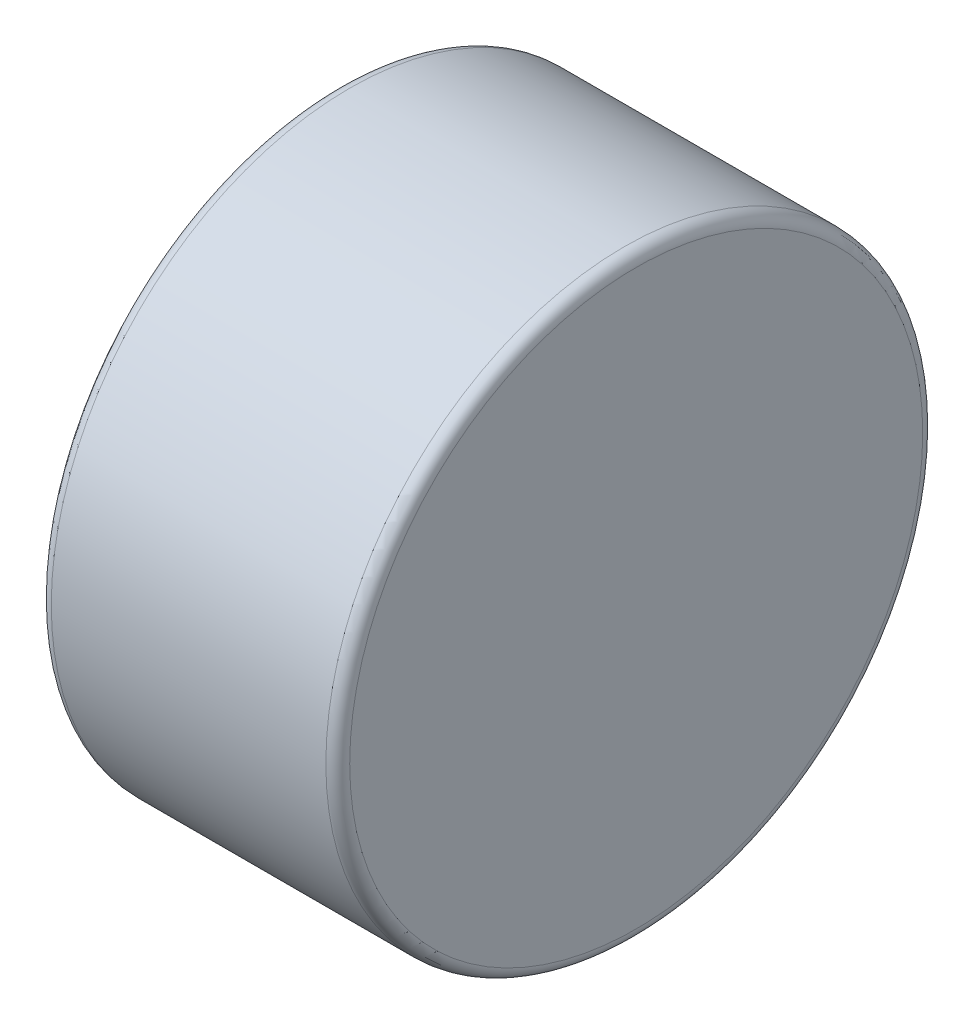
ISO-10303-21;
HEADER;
FILE_DESCRIPTION(('STEP AP214'),'2;1');
FILE_NAME('part.step','',(''),(''),'','','');
FILE_SCHEMA(('AUTOMOTIVE_DESIGN { 1 0 10303 214 1 1 1 1 }'));
ENDSEC;
DATA;
#1=APPLICATION_CONTEXT('core data for automotive mechanical design processes');
#2=APPLICATION_PROTOCOL_DEFINITION('international standard','automotive_design',2000,#1);
#3=PRODUCT_CONTEXT('',#1,'mechanical');
#4=PRODUCT('Part','Part','',(#3));
#5=PRODUCT_RELATED_PRODUCT_CATEGORY('part','',(#4));
#6=PRODUCT_DEFINITION_FORMATION('','',#4);
#7=PRODUCT_DEFINITION_CONTEXT('part definition',#1,'design');
#8=PRODUCT_DEFINITION('design','',#6,#7);
#9=PRODUCT_DEFINITION_SHAPE('','',#8);
#10=(LENGTH_UNIT() NAMED_UNIT(*) SI_UNIT(.MILLI.,.METRE.));
#11=(NAMED_UNIT(*) PLANE_ANGLE_UNIT() SI_UNIT($,.RADIAN.));
#12=(NAMED_UNIT(*) SI_UNIT($,.STERADIAN.) SOLID_ANGLE_UNIT());
#13=UNCERTAINTY_MEASURE_WITH_UNIT(LENGTH_MEASURE(1.E-05),#10,'distance_accuracy_value','');
#14=(GEOMETRIC_REPRESENTATION_CONTEXT(3) GLOBAL_UNCERTAINTY_ASSIGNED_CONTEXT((#13)) GLOBAL_UNIT_ASSIGNED_CONTEXT((#10,
#11,#12)) REPRESENTATION_CONTEXT('',''));
#15=CARTESIAN_POINT('',(0.,0.,0.));
#16=DIRECTION('',(0.,0.,1.));
#17=DIRECTION('',(1.,0.,0.));
#18=AXIS2_PLACEMENT_3D('',#15,#16,#17);
#19=CARTESIAN_POINT('',(2.5,0.,0.));
#20=DIRECTION('',(-1.,0.,0.));
#21=DIRECTION('',(0.,0.,1.));
#22=AXIS2_PLACEMENT_3D('',#19,#20,#21);
#23=CYLINDRICAL_SURFACE('',#22,5.);
#24=CARTESIAN_POINT('',(2.3,0.,0.));
#25=DIRECTION('',(1.,0.,0.));
#26=DIRECTION('',(0.,0.,-1.));
#27=AXIS2_PLACEMENT_3D('',#24,#25,#26);
#28=CIRCLE('',#27,5.);
#29=CARTESIAN_POINT('',(2.3,0.,-5.));
#30=VERTEX_POINT('',#29);
#31=EDGE_CURVE('E46',#30,#30,#28,.F.);
#32=ORIENTED_EDGE('',*,*,#31,.T.);
#33=EDGE_LOOP('',(#32));
#34=FACE_BOUND('',#33,.T.);
#35=CARTESIAN_POINT('',(-2.3,0.,0.));
#36=DIRECTION('',(1.,0.,0.));
#37=DIRECTION('',(0.,0.,-1.));
#38=AXIS2_PLACEMENT_3D('',#35,#36,#37);
#39=CIRCLE('',#38,5.);
#40=CARTESIAN_POINT('',(-2.3,0.,-5.));
#41=VERTEX_POINT('',#40);
#42=EDGE_CURVE('E50',#41,#41,#39,.T.);
#43=ORIENTED_EDGE('',*,*,#42,.T.);
#44=EDGE_LOOP('',(#43));
#45=FACE_BOUND('',#44,.T.);
#46=ADVANCED_FACE('F39',(#34,#45),#23,.T.);
#47=CARTESIAN_POINT('',(2.5,0.,0.));
#48=DIRECTION('',(1.,0.,0.));
#49=DIRECTION('',(0.,0.,-1.));
#50=AXIS2_PLACEMENT_3D('',#47,#48,#49);
#51=PLANE('',#50);
#52=CARTESIAN_POINT('',(2.5,0.,0.));
#53=DIRECTION('',(1.,0.,0.));
#54=DIRECTION('',(0.,0.,-1.));
#55=AXIS2_PLACEMENT_3D('',#52,#53,#54);
#56=CIRCLE('',#55,4.8);
#57=CARTESIAN_POINT('',(2.5,0.,-4.8));
#58=VERTEX_POINT('',#57);
#59=EDGE_CURVE('E54',#58,#58,#56,.T.);
#60=ORIENTED_EDGE('',*,*,#59,.T.);
#61=EDGE_LOOP('',(#60));
#62=FACE_BOUND('',#61,.T.);
#63=ADVANCED_FACE('F60',(#62),#51,.T.);
#64=CARTESIAN_POINT('',(-2.5,0.,0.));
#65=DIRECTION('',(1.,0.,0.));
#66=DIRECTION('',(0.,0.,-1.));
#67=AXIS2_PLACEMENT_3D('',#64,#65,#66);
#68=PLANE('',#67);
#69=CARTESIAN_POINT('',(-2.5,0.,0.));
#70=DIRECTION('',(1.,0.,0.));
#71=DIRECTION('',(0.,0.,-1.));
#72=AXIS2_PLACEMENT_3D('',#69,#70,#71);
#73=CIRCLE('',#72,4.8);
#74=CARTESIAN_POINT('',(-2.5,0.,-4.8));
#75=VERTEX_POINT('',#74);
#76=EDGE_CURVE('E10',#75,#75,#73,.F.);
#77=ORIENTED_EDGE('',*,*,#76,.T.);
#78=EDGE_LOOP('',(#77));
#79=FACE_BOUND('',#78,.T.);
#80=ADVANCED_FACE('F64',(#79),#68,.F.);
#81=CARTESIAN_POINT('',(2.3,0.,0.));
#82=DIRECTION('',(1.,0.,0.));
#83=DIRECTION('',(0.,0.,-1.));
#84=AXIS2_PLACEMENT_3D('',#81,#82,#83);
#85=TOROIDAL_SURFACE('',#84,4.8,0.2);
#86=ORIENTED_EDGE('',*,*,#31,.F.);
#87=EDGE_LOOP('',(#86));
#88=FACE_BOUND('',#87,.T.);
#89=ORIENTED_EDGE('',*,*,#59,.F.);
#90=EDGE_LOOP('',(#89));
#91=FACE_BOUND('',#90,.T.);
#92=ADVANCED_FACE('F62',(#88,#91),#85,.T.);
#93=CARTESIAN_POINT('',(-2.3,0.,0.));
#94=DIRECTION('',(1.,0.,0.));
#95=DIRECTION('',(0.,0.,-1.));
#96=AXIS2_PLACEMENT_3D('',#93,#94,#95);
#97=TOROIDAL_SURFACE('',#96,4.8,0.2);
#98=ORIENTED_EDGE('',*,*,#76,.F.);
#99=EDGE_LOOP('',(#98));
#100=FACE_BOUND('',#99,.T.);
#101=ORIENTED_EDGE('',*,*,#42,.F.);
#102=EDGE_LOOP('',(#101));
#103=FACE_BOUND('',#102,.T.);
#104=ADVANCED_FACE('F41',(#100,#103),#97,.T.);
#105=CLOSED_SHELL('',(#46,#63,#80,#92,#104));
#106=MANIFOLD_SOLID_BREP('B2',#105);
#107=ADVANCED_BREP_SHAPE_REPRESENTATION('',(#18,#106),#14);
#108=SHAPE_DEFINITION_REPRESENTATION(#9,#107);
ENDSEC;
END-ISO-10303-21;
